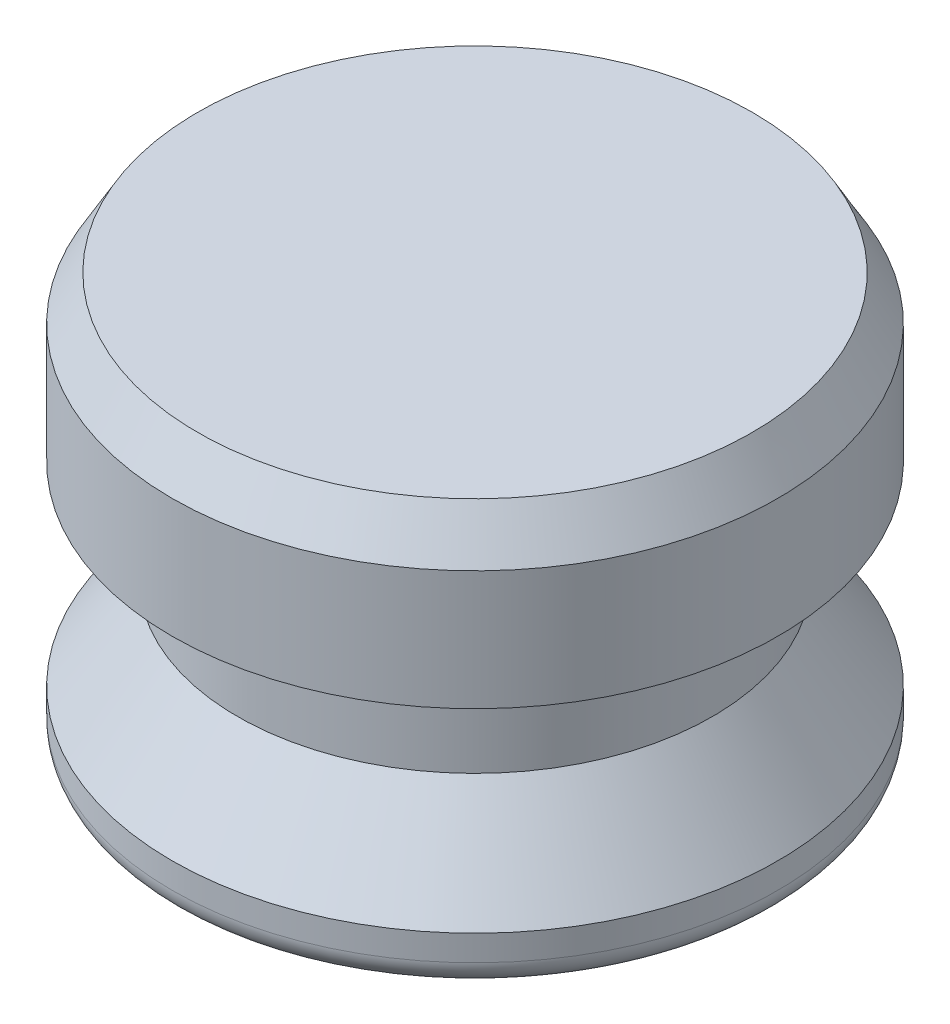
ISO-10303-21;
HEADER;
FILE_DESCRIPTION(('STEP AP214'),'2;1');
FILE_NAME('part.step','',(''),(''),'','','');
FILE_SCHEMA(('AUTOMOTIVE_DESIGN { 1 0 10303 214 1 1 1 1 }'));
ENDSEC;
DATA;
#1=APPLICATION_CONTEXT('core data for automotive mechanical design processes');
#2=APPLICATION_PROTOCOL_DEFINITION('international standard','automotive_design',2000,#1);
#3=PRODUCT_CONTEXT('',#1,'mechanical');
#4=PRODUCT('Part','Part','',(#3));
#5=PRODUCT_RELATED_PRODUCT_CATEGORY('part','',(#4));
#6=PRODUCT_DEFINITION_FORMATION('','',#4);
#7=PRODUCT_DEFINITION_CONTEXT('part definition',#1,'design');
#8=PRODUCT_DEFINITION('design','',#6,#7);
#9=PRODUCT_DEFINITION_SHAPE('','',#8);
#10=(LENGTH_UNIT() NAMED_UNIT(*) SI_UNIT(.MILLI.,.METRE.));
#11=(NAMED_UNIT(*) PLANE_ANGLE_UNIT() SI_UNIT($,.RADIAN.));
#12=(NAMED_UNIT(*) SI_UNIT($,.STERADIAN.) SOLID_ANGLE_UNIT());
#13=UNCERTAINTY_MEASURE_WITH_UNIT(LENGTH_MEASURE(1.E-05),#10,'distance_accuracy_value','');
#14=(GEOMETRIC_REPRESENTATION_CONTEXT(3) GLOBAL_UNCERTAINTY_ASSIGNED_CONTEXT((#13)) GLOBAL_UNIT_ASSIGNED_CONTEXT((#10,
#11,#12)) REPRESENTATION_CONTEXT('',''));
#15=CARTESIAN_POINT('',(0.,0.,0.));
#16=DIRECTION('',(0.,0.,1.));
#17=DIRECTION('',(1.,0.,0.));
#18=AXIS2_PLACEMENT_3D('',#15,#16,#17);
#19=CARTESIAN_POINT('',(0.,0.,0.));
#20=DIRECTION('',(0.,1.,0.));
#21=DIRECTION('',(0.,0.,1.));
#22=AXIS2_PLACEMENT_3D('',#19,#20,#21);
#23=PLANE('',#22);
#24=CARTESIAN_POINT('',(0.,0.,0.));
#25=DIRECTION('',(0.,1.,0.));
#26=DIRECTION('',(0.,0.,1.));
#27=AXIS2_PLACEMENT_3D('',#24,#25,#26);
#28=CIRCLE('',#27,8.60425);
#29=CARTESIAN_POINT('',(0.,0.,8.60425));
#30=VERTEX_POINT('',#29);
#31=EDGE_CURVE('E45',#30,#30,#28,.F.);
#32=ORIENTED_EDGE('',*,*,#31,.T.);
#33=EDGE_LOOP('',(#32));
#34=FACE_BOUND('',#33,.T.);
#35=ADVANCED_FACE('F30',(#34),#23,.F.);
#36=CARTESIAN_POINT('',(0.,0.,0.));
#37=DIRECTION('',(0.,-1.,0.));
#38=DIRECTION('',(0.,0.,-1.));
#39=AXIS2_PLACEMENT_3D('',#36,#37,#38);
#40=CYLINDRICAL_SURFACE('',#39,9.398);
#41=CARTESIAN_POINT('',(0.,0.793749999999999,0.));
#42=DIRECTION('',(0.,1.,0.));
#43=DIRECTION('',(0.,0.,1.));
#44=AXIS2_PLACEMENT_3D('',#41,#42,#43);
#45=CIRCLE('',#44,9.398);
#46=CARTESIAN_POINT('',(0.,0.793749999999999,9.398));
#47=VERTEX_POINT('',#46);
#48=EDGE_CURVE('E41',#47,#47,#45,.T.);
#49=ORIENTED_EDGE('',*,*,#48,.T.);
#50=EDGE_LOOP('',(#49));
#51=FACE_BOUND('',#50,.T.);
#52=CARTESIAN_POINT('',(0.,1.5875,0.));
#53=DIRECTION('',(0.,-1.,0.));
#54=DIRECTION('',(0.,0.,-1.));
#55=AXIS2_PLACEMENT_3D('',#52,#53,#54);
#56=CIRCLE('',#55,9.398);
#57=CARTESIAN_POINT('',(0.,1.5875,-9.398));
#58=VERTEX_POINT('',#57);
#59=EDGE_CURVE('E50',#58,#58,#56,.T.);
#60=ORIENTED_EDGE('',*,*,#59,.T.);
#61=EDGE_LOOP('',(#60));
#62=FACE_BOUND('',#61,.T.);
#63=ADVANCED_FACE('F79',(#51,#62),#40,.T.);
#64=CARTESIAN_POINT('',(0.,4.445,0.));
#65=DIRECTION('',(0.,-1.,0.));
#66=DIRECTION('',(0.,0.,-1.));
#67=AXIS2_PLACEMENT_3D('',#64,#65,#66);
#68=CONICAL_SURFACE('',#67,7.366,0.618144225935187);
#69=ORIENTED_EDGE('',*,*,#59,.F.);
#70=EDGE_LOOP('',(#69));
#71=FACE_BOUND('',#70,.T.);
#72=CARTESIAN_POINT('',(0.,4.445,0.));
#73=DIRECTION('',(0.,-1.,0.));
#74=DIRECTION('',(0.,0.,-1.));
#75=AXIS2_PLACEMENT_3D('',#72,#73,#74);
#76=CIRCLE('',#75,7.366);
#77=CARTESIAN_POINT('',(0.,4.445,-7.366));
#78=VERTEX_POINT('',#77);
#79=EDGE_CURVE('E53',#78,#78,#76,.T.);
#80=ORIENTED_EDGE('',*,*,#79,.T.);
#81=EDGE_LOOP('',(#80));
#82=FACE_BOUND('',#81,.T.);
#83=ADVANCED_FACE('F85',(#71,#82),#68,.T.);
#84=CARTESIAN_POINT('',(0.,0.,0.));
#85=DIRECTION('',(0.,-1.,0.));
#86=DIRECTION('',(0.,0.,-1.));
#87=AXIS2_PLACEMENT_3D('',#84,#85,#86);
#88=CYLINDRICAL_SURFACE('',#87,7.366);
#89=ORIENTED_EDGE('',*,*,#79,.F.);
#90=EDGE_LOOP('',(#89));
#91=FACE_BOUND('',#90,.T.);
#92=CARTESIAN_POINT('',(0.,7.62,0.));
#93=DIRECTION('',(0.,-1.,0.));
#94=DIRECTION('',(0.,0.,-1.));
#95=AXIS2_PLACEMENT_3D('',#92,#93,#94);
#96=CIRCLE('',#95,7.366);
#97=CARTESIAN_POINT('',(0.,7.62,-7.366));
#98=VERTEX_POINT('',#97);
#99=EDGE_CURVE('E56',#98,#98,#96,.T.);
#100=ORIENTED_EDGE('',*,*,#99,.T.);
#101=EDGE_LOOP('',(#100));
#102=FACE_BOUND('',#101,.T.);
#103=ADVANCED_FACE('F75',(#91,#102),#88,.T.);
#104=CARTESIAN_POINT('',(-7.366,7.62,0.));
#105=DIRECTION('',(0.,1.,0.));
#106=DIRECTION('',(0.,0.,1.));
#107=AXIS2_PLACEMENT_3D('',#104,#105,#106);
#108=PLANE('',#107);
#109=ORIENTED_EDGE('',*,*,#99,.F.);
#110=EDGE_LOOP('',(#109));
#111=FACE_BOUND('',#110,.T.);
#112=CARTESIAN_POINT('',(0.,7.62,0.));
#113=DIRECTION('',(0.,-1.,0.));
#114=DIRECTION('',(0.,0.,-1.));
#115=AXIS2_PLACEMENT_3D('',#112,#113,#114);
#116=CIRCLE('',#115,9.398);
#117=CARTESIAN_POINT('',(0.,7.62,-9.398));
#118=VERTEX_POINT('',#117);
#119=EDGE_CURVE('E59',#118,#118,#116,.T.);
#120=ORIENTED_EDGE('',*,*,#119,.T.);
#121=EDGE_LOOP('',(#120));
#122=FACE_BOUND('',#121,.T.);
#123=ADVANCED_FACE('F63',(#111,#122),#108,.F.);
#124=CARTESIAN_POINT('',(0.,0.,0.));
#125=DIRECTION('',(0.,-1.,0.));
#126=DIRECTION('',(0.,0.,-1.));
#127=AXIS2_PLACEMENT_3D('',#124,#125,#126);
#128=CYLINDRICAL_SURFACE('',#127,9.398);
#129=CARTESIAN_POINT('',(0.,11.3251846714922,0.));
#130=DIRECTION('',(0.,-1.,0.));
#131=DIRECTION('',(0.,0.,-1.));
#132=AXIS2_PLACEMENT_3D('',#129,#130,#131);
#133=CIRCLE('',#132,9.398);
#134=CARTESIAN_POINT('',(0.,11.3251846714922,-9.398));
#135=VERTEX_POINT('',#134);
#136=EDGE_CURVE('E37',#135,#135,#133,.T.);
#137=ORIENTED_EDGE('',*,*,#136,.T.);
#138=EDGE_LOOP('',(#137));
#139=FACE_BOUND('',#138,.T.);
#140=ORIENTED_EDGE('',*,*,#119,.F.);
#141=EDGE_LOOP('',(#140));
#142=FACE_BOUND('',#141,.T.);
#143=ADVANCED_FACE('F65',(#139,#142),#128,.T.);
#144=CARTESIAN_POINT('',(-9.398,12.7,0.));
#145=DIRECTION('',(0.,-1.,0.));
#146=DIRECTION('',(0.,0.,-1.));
#147=AXIS2_PLACEMENT_3D('',#144,#145,#146);
#148=PLANE('',#147);
#149=CARTESIAN_POINT('',(0.,12.7,0.));
#150=DIRECTION('',(0.,-1.,0.));
#151=DIRECTION('',(0.,0.,-1.));
#152=AXIS2_PLACEMENT_3D('',#149,#150,#151);
#153=CIRCLE('',#152,8.60424999999999);
#154=CARTESIAN_POINT('',(0.,12.7,-8.60424999999999));
#155=VERTEX_POINT('',#154);
#156=EDGE_CURVE('E10',#155,#155,#153,.F.);
#157=ORIENTED_EDGE('',*,*,#156,.T.);
#158=EDGE_LOOP('',(#157));
#159=FACE_BOUND('',#158,.T.);
#160=ADVANCED_FACE('F67',(#159),#148,.F.);
#161=CARTESIAN_POINT('',(0.,0.793749999999999,0.));
#162=DIRECTION('',(0.,1.,0.));
#163=DIRECTION('',(0.,0.,1.));
#164=AXIS2_PLACEMENT_3D('',#161,#162,#163);
#165=TOROIDAL_SURFACE('',#164,8.60425,0.79375);
#166=ORIENTED_EDGE('',*,*,#48,.F.);
#167=EDGE_LOOP('',(#166));
#168=FACE_BOUND('',#167,.T.);
#169=ORIENTED_EDGE('',*,*,#31,.F.);
#170=EDGE_LOOP('',(#169));
#171=FACE_BOUND('',#170,.T.);
#172=ADVANCED_FACE('F73',(#168,#171),#165,.T.);
#173=CARTESIAN_POINT('',(0.,11.3251846714922,0.));
#174=DIRECTION('',(0.,-1.,0.));
#175=DIRECTION('',(0.,0.,-1.));
#176=AXIS2_PLACEMENT_3D('',#173,#174,#175);
#177=CONICAL_SURFACE('',#176,9.398,0.5235987755983);
#178=ORIENTED_EDGE('',*,*,#156,.F.);
#179=EDGE_LOOP('',(#178));
#180=FACE_BOUND('',#179,.T.);
#181=ORIENTED_EDGE('',*,*,#136,.F.);
#182=EDGE_LOOP('',(#181));
#183=FACE_BOUND('',#182,.T.);
#184=ADVANCED_FACE('F32',(#180,#183),#177,.T.);
#185=CLOSED_SHELL('',(#35,#63,#83,#103,#123,#143,#160,#172,#184));
#186=MANIFOLD_SOLID_BREP('B2',#185);
#187=ADVANCED_BREP_SHAPE_REPRESENTATION('',(#18,#186),#14);
#188=SHAPE_DEFINITION_REPRESENTATION(#9,#187);
ENDSEC;
END-ISO-10303-21;
